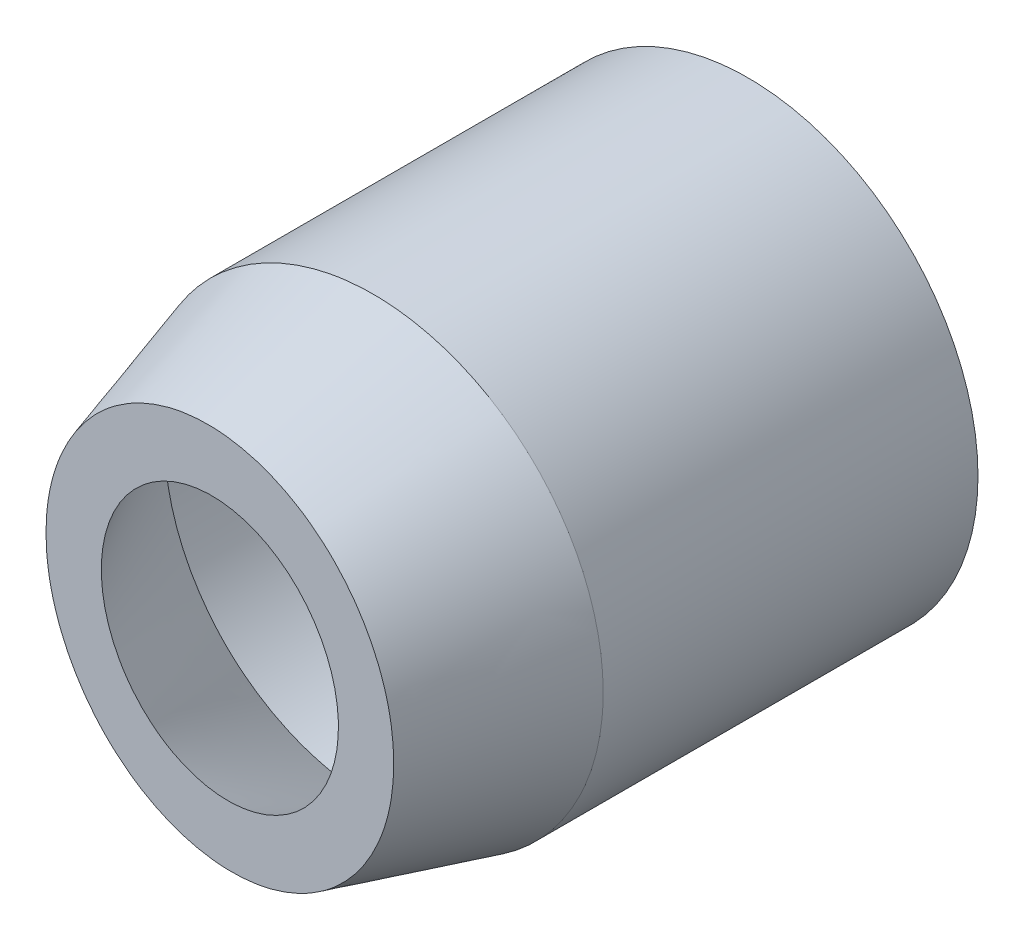
ISO-10303-21;
HEADER;
FILE_DESCRIPTION(('STEP AP214'),'2;1');
FILE_NAME('part.step','',(''),(''),'','','');
FILE_SCHEMA(('AUTOMOTIVE_DESIGN { 1 0 10303 214 1 1 1 1 }'));
ENDSEC;
DATA;
#1=APPLICATION_CONTEXT('core data for automotive mechanical design processes');
#2=APPLICATION_PROTOCOL_DEFINITION('international standard','automotive_design',2000,#1);
#3=PRODUCT_CONTEXT('',#1,'mechanical');
#4=PRODUCT('Part','Part','',(#3));
#5=PRODUCT_RELATED_PRODUCT_CATEGORY('part','',(#4));
#6=PRODUCT_DEFINITION_FORMATION('','',#4);
#7=PRODUCT_DEFINITION_CONTEXT('part definition',#1,'design');
#8=PRODUCT_DEFINITION('design','',#6,#7);
#9=PRODUCT_DEFINITION_SHAPE('','',#8);
#10=(LENGTH_UNIT() NAMED_UNIT(*) SI_UNIT(.MILLI.,.METRE.));
#11=(NAMED_UNIT(*) PLANE_ANGLE_UNIT() SI_UNIT($,.RADIAN.));
#12=(NAMED_UNIT(*) SI_UNIT($,.STERADIAN.) SOLID_ANGLE_UNIT());
#13=UNCERTAINTY_MEASURE_WITH_UNIT(LENGTH_MEASURE(1.E-05),#10,'distance_accuracy_value','');
#14=(GEOMETRIC_REPRESENTATION_CONTEXT(3) GLOBAL_UNCERTAINTY_ASSIGNED_CONTEXT((#13)) GLOBAL_UNIT_ASSIGNED_CONTEXT((#10,
#11,#12)) REPRESENTATION_CONTEXT('',''));
#15=CARTESIAN_POINT('',(0.,0.,0.));
#16=DIRECTION('',(0.,0.,1.));
#17=DIRECTION('',(1.,0.,0.));
#18=AXIS2_PLACEMENT_3D('',#15,#16,#17);
#19=CARTESIAN_POINT('',(0.,0.,0.));
#20=DIRECTION('',(0.,0.,1.));
#21=DIRECTION('',(1.,0.,0.));
#22=AXIS2_PLACEMENT_3D('',#19,#20,#21);
#23=PLANE('',#22);
#24=CARTESIAN_POINT('',(0.,0.,0.));
#25=DIRECTION('',(0.,0.,1.));
#26=DIRECTION('',(1.,0.,0.));
#27=AXIS2_PLACEMENT_3D('',#24,#25,#26);
#28=CIRCLE('',#27,13.5);
#29=CARTESIAN_POINT('',(13.5,0.,0.));
#30=VERTEX_POINT('',#29);
#31=EDGE_CURVE('E75',#30,#30,#28,.T.);
#32=ORIENTED_EDGE('',*,*,#31,.F.);
#33=EDGE_LOOP('',(#32));
#34=FACE_BOUND('',#33,.T.);
#35=CARTESIAN_POINT('',(0.,0.,0.));
#36=DIRECTION('',(0.,0.,1.));
#37=DIRECTION('',(1.,0.,0.));
#38=AXIS2_PLACEMENT_3D('',#35,#36,#37);
#39=CIRCLE('',#38,12.25);
#40=CARTESIAN_POINT('',(12.25,0.,0.));
#41=VERTEX_POINT('',#40);
#42=EDGE_CURVE('E81',#41,#41,#39,.T.);
#43=ORIENTED_EDGE('',*,*,#42,.T.);
#44=EDGE_LOOP('',(#43));
#45=FACE_BOUND('',#44,.T.);
#46=ADVANCED_FACE('F63',(#34,#45),#23,.F.);
#47=CARTESIAN_POINT('',(0.,0.,22.));
#48=DIRECTION('',(0.,0.,-1.));
#49=DIRECTION('',(-1.,0.,0.));
#50=AXIS2_PLACEMENT_3D('',#47,#48,#49);
#51=CYLINDRICAL_SURFACE('',#50,13.5);
#52=CARTESIAN_POINT('',(13.5,0.,21.999999942));
#53=CARTESIAN_POINT('',(13.5,0.5625,21.999999942));
#54=CARTESIAN_POINT('',(13.4651108152557,1.16050591275746,21.999999942));
#55=CARTESIAN_POINT('',(13.295951131647,2.42356488370272,21.999999942));
#56=CARTESIAN_POINT('',(13.1616,3.0888,21.999999942));
#57=CARTESIAN_POINT('',(12.7584,4.4712,21.999999942));
#58=CARTESIAN_POINT('',(12.4893321550309,5.18854942557758,21.999999942));
#59=CARTESIAN_POINT('',(11.7803307663174,6.64291124857972,21.999999942));
#60=CARTESIAN_POINT('',(11.34,7.38,21.999999942));
#61=CARTESIAN_POINT('',(10.26,8.82,21.999999942));
#62=CARTESIAN_POINT('',(9.61981610058172,9.52270594858322,21.999999942));
#63=CARTESIAN_POINT('',(8.13360855695252,10.8197598048414,21.999999942));
#64=CARTESIAN_POINT('',(7.28719723183391,11.4134948096886,21.999999942));
#65=CARTESIAN_POINT('',(5.41868512110727,12.4100346020761,21.999999942));
#66=CARTESIAN_POINT('',(4.39668639053255,12.8119526627219,21.999999942));
#67=CARTESIAN_POINT('',(2.2494674556213,13.3572781065089,21.999999942));
#68=CARTESIAN_POINT('',(1.125,13.5,21.999999942));
#69=CARTESIAN_POINT('',(-1.125,13.5,21.999999942));
#70=CARTESIAN_POINT('',(-2.2494674556213,13.3572781065089,21.999999942));
#71=CARTESIAN_POINT('',(-4.39668639053254,12.8119526627219,21.999999942));
#72=CARTESIAN_POINT('',(-5.41868512110727,12.4100346020761,21.999999942));
#73=CARTESIAN_POINT('',(-7.28719723183391,11.4134948096886,21.999999942));
#74=CARTESIAN_POINT('',(-8.13360855695252,10.8197598048414,21.999999942));
#75=CARTESIAN_POINT('',(-9.61981610058172,9.52270594858322,21.999999942));
#76=CARTESIAN_POINT('',(-10.26,8.82,21.999999942));
#77=CARTESIAN_POINT('',(-11.34,7.38,21.999999942));
#78=CARTESIAN_POINT('',(-11.7803307663174,6.64291124857973,21.999999942));
#79=CARTESIAN_POINT('',(-12.4893321550309,5.18854942557758,21.999999942));
#80=CARTESIAN_POINT('',(-12.7584,4.4712,21.999999942));
#81=CARTESIAN_POINT('',(-13.1616,3.0888,21.999999942));
#82=CARTESIAN_POINT('',(-13.295951131647,2.42356488370272,21.999999942));
#83=CARTESIAN_POINT('',(-13.4651108152557,1.16050591275746,21.999999942));
#84=CARTESIAN_POINT('',(-13.5,0.562500000000001,21.999999942));
#85=CARTESIAN_POINT('',(-13.5,-0.562499999999998,21.999999942));
#86=CARTESIAN_POINT('',(-13.4651108152557,-1.16050591275746,21.999999942));
#87=CARTESIAN_POINT('',(-13.295951131647,-2.42356488370272,21.999999942));
#88=CARTESIAN_POINT('',(-13.1616,-3.0888,21.999999942));
#89=CARTESIAN_POINT('',(-12.7584,-4.4712,21.999999942));
#90=CARTESIAN_POINT('',(-12.4893321550309,-5.18854942557758,21.999999942));
#91=CARTESIAN_POINT('',(-11.7803307663174,-6.64291124857972,21.999999942));
#92=CARTESIAN_POINT('',(-11.34,-7.37999999999999,21.999999942));
#93=CARTESIAN_POINT('',(-10.26,-8.82,21.999999942));
#94=CARTESIAN_POINT('',(-9.61981610058172,-9.52270594858322,21.999999942));
#95=CARTESIAN_POINT('',(-8.13360855695253,-10.8197598048414,21.999999942));
#96=CARTESIAN_POINT('',(-7.28719723183391,-11.4134948096886,21.999999942));
#97=CARTESIAN_POINT('',(-5.41868512110727,-12.4100346020761,21.999999942));
#98=CARTESIAN_POINT('',(-4.39668639053255,-12.8119526627219,21.999999942));
#99=CARTESIAN_POINT('',(-2.2494674556213,-13.3572781065089,21.999999942));
#100=CARTESIAN_POINT('',(-1.12499999999999,-13.5,21.999999942));
#101=CARTESIAN_POINT('',(1.125,-13.5,21.999999942));
#102=CARTESIAN_POINT('',(2.2494674556213,-13.3572781065089,21.999999942));
#103=CARTESIAN_POINT('',(4.39668639053254,-12.8119526627219,21.999999942));
#104=CARTESIAN_POINT('',(5.41868512110727,-12.4100346020761,21.999999942));
#105=CARTESIAN_POINT('',(7.28719723183391,-11.4134948096886,21.999999942));
#106=CARTESIAN_POINT('',(8.13360855695252,-10.8197598048414,21.999999942));
#107=CARTESIAN_POINT('',(9.61981610058172,-9.52270594858322,21.999999942));
#108=CARTESIAN_POINT('',(10.26,-8.82,21.999999942));
#109=CARTESIAN_POINT('',(11.34,-7.38,21.999999942));
#110=CARTESIAN_POINT('',(11.7803307663174,-6.64291124857973,21.999999942));
#111=CARTESIAN_POINT('',(12.4893321550309,-5.18854942557758,21.999999942));
#112=CARTESIAN_POINT('',(12.7584,-4.4712,21.999999942));
#113=CARTESIAN_POINT('',(13.1616,-3.0888,21.999999942));
#114=CARTESIAN_POINT('',(13.295951131647,-2.42356488370272,21.999999942));
#115=CARTESIAN_POINT('',(13.4651108152557,-1.16050591275746,21.999999942));
#116=CARTESIAN_POINT('',(13.5,-0.562499999999997,21.999999942));
#117=CARTESIAN_POINT('',(13.5,0.,21.999999942));
#118=B_SPLINE_CURVE_WITH_KNOTS('',3,(#52,#53,#54,#55,#56,#57,#58,#59,#60,#61,#62,#63,#64,#65,
#66,#67,#68,#69,#70,#71,#72,#73,#74,#75,#76,#77,#78,#79,#80,#81,#82,#83,#84,#85,#86,#87,#88,#89,
#90,#91,#92,#93,#94,#95,#96,#97,#98,#99,#100,#101,#102,#103,#104,#105,#106,#107,#108,#109,#110,
#111,#112,#113,#114,#115,#116,#117),.UNSPECIFIED.,.T.,.F.,(4,2,2,2,2,2,2,2,2,2,2,2,2,2,2,2,2,2,
2,2,2,2,2,2,2,2,2,2,2,2,2,2,4),(0.,0.03125,0.0625,0.09375,0.125,0.15625,0.1875,0.21875,0.25,
0.28125,0.3125,0.34375,0.375,0.40625,0.4375,0.46875,0.5,0.53125,0.5625,0.59375,0.625,0.65625,
0.6875,0.71875,0.75,0.78125,0.8125,0.84375,0.875,0.90625,0.9375,0.96875,1.),.UNSPECIFIED.);
#119=CARTESIAN_POINT('',(13.5,0.,21.999999942));
#120=VERTEX_POINT('',#119);
#121=EDGE_CURVE('E11',#120,#120,#118,.T.);
#122=ORIENTED_EDGE('',*,*,#121,.F.);
#123=EDGE_LOOP('',(#122));
#124=FACE_BOUND('',#123,.T.);
#125=ORIENTED_EDGE('',*,*,#31,.T.);
#126=EDGE_LOOP('',(#125));
#127=FACE_BOUND('',#126,.T.);
#128=ADVANCED_FACE('F65',(#124,#127),#51,.T.);
#129=CARTESIAN_POINT('',(0.,0.,22.));
#130=DIRECTION('',(0.,0.,-1.));
#131=DIRECTION('',(-1.,0.,0.));
#132=AXIS2_PLACEMENT_3D('',#129,#130,#131);
#133=CYLINDRICAL_SURFACE('',#132,12.25);
#134=CARTESIAN_POINT('',(0.,0.,21.999999942));
#135=DIRECTION('',(0.,0.,1.));
#136=DIRECTION('',(1.,0.,0.));
#137=AXIS2_PLACEMENT_3D('',#134,#135,#136);
#138=CIRCLE('',#137,12.25);
#139=CARTESIAN_POINT('',(6.40716884169675,10.4408183316247,21.999999942));
#140=VERTEX_POINT('',#139);
#141=EDGE_CURVE('E105',#140,#140,#138,.T.);
#142=ORIENTED_EDGE('',*,*,#141,.T.);
#143=EDGE_LOOP('',(#142));
#144=FACE_BOUND('',#143,.T.);
#145=ORIENTED_EDGE('',*,*,#42,.F.);
#146=EDGE_LOOP('',(#145));
#147=FACE_BOUND('',#146,.T.);
#148=ADVANCED_FACE('F110',(#144,#147),#133,.F.);
#149=CARTESIAN_POINT('',(0.,0.,30.999999976));
#150=DIRECTION('',(-0.0697564737441255,0.,0.997564050259824));
#151=DIRECTION('',(0.997564050259824,0.,0.0697564737441255));
#152=AXIS2_PLACEMENT_3D('',#149,#150,#151);
#153=PLANE('',#152);
#154=CARTESIAN_POINT('',(0.,0.,30.999999976));
#155=DIRECTION('',(-0.0697564737441255,0.,0.997564050259824));
#156=DIRECTION('',(0.997564050259824,0.,0.0697564737441255));
#157=AXIS2_PLACEMENT_3D('',#154,#155,#156);
#158=CIRCLE('',#157,7.5);
#159=CARTESIAN_POINT('',(4.9159422917228,5.6537901516199,31.3437561481585));
#160=VERTEX_POINT('',#159);
#161=EDGE_CURVE('E201',#160,#160,#158,.T.);
#162=ORIENTED_EDGE('',*,*,#161,.F.);
#163=EDGE_LOOP('',(#162));
#164=FACE_BOUND('',#163,.T.);
#165=CARTESIAN_POINT('',(0.,0.,30.999999976));
#166=DIRECTION('',(-0.0697564737441255,0.,0.997564050259824));
#167=DIRECTION('',(0.997564050259824,0.,0.0697564737441255));
#168=AXIS2_PLACEMENT_3D('',#165,#166,#167);
#169=CIRCLE('',#168,11.);
#170=CARTESIAN_POINT('',(10.9732045528581,0.,31.7673211871854));
#171=VERTEX_POINT('',#170);
#172=EDGE_CURVE('E87',#171,#171,#169,.T.);
#173=ORIENTED_EDGE('',*,*,#172,.T.);
#174=EDGE_LOOP('',(#173));
#175=FACE_BOUND('',#174,.T.);
#176=ADVANCED_FACE('F118',(#164,#175),#153,.T.);
#177=CARTESIAN_POINT('',(13.5,0.,21.999999942));
#178=CARTESIAN_POINT('',(10.9732045528581,0.,31.7673211871854));
#179=CARTESIAN_POINT('',(13.5,0.5625,21.999999942));
#180=CARTESIAN_POINT('',(10.9732045528581,0.458333333333333,31.7673211871854));
#181=CARTESIAN_POINT('',(13.4651108152557,1.16050591275746,21.999999942));
#182=CARTESIAN_POINT('',(10.9448455779779,0.945597410394967,31.765338134482));
#183=CARTESIAN_POINT('',(13.295951131647,2.42356488370272,21.999999942));
#184=CARTESIAN_POINT('',(10.8073475179531,1.97475657190592,31.7557233334961));
#185=CARTESIAN_POINT('',(13.1616,3.0888,21.999999942));
#186=CARTESIAN_POINT('',(10.6981428920664,2.5168,31.7480870021583));
#187=CARTESIAN_POINT('',(12.7584,4.4712,21.999999942));
#188=CARTESIAN_POINT('',(10.3704098494211,3.6432,31.7251696753176));
#189=CARTESIAN_POINT('',(12.4893321550309,5.18854942557758,21.999999942));
#190=CARTESIAN_POINT('',(10.1517034419068,4.22770693935951,31.7098762334885));
#191=CARTESIAN_POINT('',(11.7803307663174,6.64291124857972,21.999999942));
#192=CARTESIAN_POINT('',(9.57540586660206,5.41274249884274,31.6695775813167));
#193=CARTESIAN_POINT('',(11.34,7.38,21.999999942));
#194=CARTESIAN_POINT('',(9.21749182440077,6.01333333333333,31.6445497933957));
#195=CARTESIAN_POINT('',(10.26,8.82,21.999999942));
#196=CARTESIAN_POINT('',(8.33963546017213,7.18666666666667,31.5831640965009));
#197=CARTESIAN_POINT('',(9.61981610058172,9.52270594858322,21.999999942));
#198=CARTESIAN_POINT('',(7.8192748024119,7.75924188403077,31.5467769346429));
#199=CARTESIAN_POINT('',(8.13360855695252,10.8197598048414,21.999999942));
#200=CARTESIAN_POINT('',(6.61124077394939,8.81610058172265,31.4623029663132));
#201=CARTESIAN_POINT('',(7.28719723183391,11.4134948096886,21.999999942));
#202=CARTESIAN_POINT('',(5.92325228458775,9.29988465974625,31.4141941245983));
#203=CARTESIAN_POINT('',(5.41868512110727,12.4100346020761,21.999999942));
#204=CARTESIAN_POINT('',(4.40446964751397,10.1118800461361,31.3079904967526));
#205=CARTESIAN_POINT('',(4.39668639053255,12.8119526627219,21.999999942));
#206=CARTESIAN_POINT('',(3.57375845319117,10.4393688362919,31.2499015112879));
#207=CARTESIAN_POINT('',(2.2494674556213,13.3572781065089,21.999999942));
#208=CARTESIAN_POINT('',(1.82843455744665,10.883708086785,31.1278565754496));
#209=CARTESIAN_POINT('',(1.125,13.5,21.999999942));
#210=CARTESIAN_POINT('',(0.914433712738173,11.,31.0639434102655));
#211=CARTESIAN_POINT('',(-1.125,13.5,21.999999942));
#212=CARTESIAN_POINT('',(-0.914433712738171,11.,30.9360565417346));
#213=CARTESIAN_POINT('',(-2.2494674556213,13.3572781065089,21.999999942));
#214=CARTESIAN_POINT('',(-1.82843455744664,10.883708086785,30.8721433765504));
#215=CARTESIAN_POINT('',(-4.39668639053254,12.8119526627219,21.999999942));
#216=CARTESIAN_POINT('',(-3.57375845319117,10.4393688362919,30.7500984407122));
#217=CARTESIAN_POINT('',(-5.41868512110727,12.4100346020761,21.999999942));
#218=CARTESIAN_POINT('',(-4.40446964751396,10.1118800461361,30.6920094552474));
#219=CARTESIAN_POINT('',(-7.28719723183391,11.4134948096886,21.999999942));
#220=CARTESIAN_POINT('',(-5.92325228458774,9.29988465974625,30.5858058274017));
#221=CARTESIAN_POINT('',(-8.13360855695252,10.8197598048414,21.999999942));
#222=CARTESIAN_POINT('',(-6.61124077394939,8.81610058172265,30.5376969856868));
#223=CARTESIAN_POINT('',(-9.61981610058172,9.52270594858322,21.999999942));
#224=CARTESIAN_POINT('',(-7.8192748024119,7.75924188403078,30.4532230173571));
#225=CARTESIAN_POINT('',(-10.26,8.82,21.999999942));
#226=CARTESIAN_POINT('',(-8.33963546017213,7.18666666666667,30.4168358554991));
#227=CARTESIAN_POINT('',(-11.34,7.38,21.999999942));
#228=CARTESIAN_POINT('',(-9.21749182440077,6.01333333333334,30.3554501586043));
#229=CARTESIAN_POINT('',(-11.7803307663174,6.64291124857973,21.999999942));
#230=CARTESIAN_POINT('',(-9.57540586660206,5.41274249884274,30.3304223706833));
#231=CARTESIAN_POINT('',(-12.4893321550309,5.18854942557758,21.999999942));
#232=CARTESIAN_POINT('',(-10.1517034419068,4.22770693935951,30.2901237185115));
#233=CARTESIAN_POINT('',(-12.7584,4.4712,21.999999942));
#234=CARTESIAN_POINT('',(-10.3704098494211,3.6432,30.2748302766824));
#235=CARTESIAN_POINT('',(-13.1616,3.0888,21.999999942));
#236=CARTESIAN_POINT('',(-10.6981428920664,2.5168,30.2519129498417));
#237=CARTESIAN_POINT('',(-13.295951131647,2.42356488370272,21.999999942));
#238=CARTESIAN_POINT('',(-10.8073475179531,1.97475657190592,30.2442766185039));
#239=CARTESIAN_POINT('',(-13.4651108152557,1.16050591275746,21.999999942));
#240=CARTESIAN_POINT('',(-10.9448455779779,0.945597410394967,30.234661817518));
#241=CARTESIAN_POINT('',(-13.5,0.562500000000001,21.999999942));
#242=CARTESIAN_POINT('',(-10.9732045528581,0.458333333333333,30.2326787648146));
#243=CARTESIAN_POINT('',(-13.5,-0.562499999999998,21.999999942));
#244=CARTESIAN_POINT('',(-10.9732045528581,-0.458333333333332,30.2326787648146));
#245=CARTESIAN_POINT('',(-13.4651108152557,-1.16050591275746,21.999999942));
#246=CARTESIAN_POINT('',(-10.9448455779779,-0.945597410394966,30.234661817518));
#247=CARTESIAN_POINT('',(-13.295951131647,-2.42356488370272,21.999999942));
#248=CARTESIAN_POINT('',(-10.8073475179531,-1.97475657190592,30.2442766185039));
#249=CARTESIAN_POINT('',(-13.1616,-3.0888,21.999999942));
#250=CARTESIAN_POINT('',(-10.6981428920664,-2.5168,30.2519129498417));
#251=CARTESIAN_POINT('',(-12.7584,-4.4712,21.999999942));
#252=CARTESIAN_POINT('',(-10.3704098494211,-3.6432,30.2748302766824));
#253=CARTESIAN_POINT('',(-12.4893321550309,-5.18854942557758,21.999999942));
#254=CARTESIAN_POINT('',(-10.1517034419068,-4.22770693935951,30.2901237185115));
#255=CARTESIAN_POINT('',(-11.7803307663174,-6.64291124857972,21.999999942));
#256=CARTESIAN_POINT('',(-9.57540586660206,-5.41274249884274,30.3304223706833));
#257=CARTESIAN_POINT('',(-11.34,-7.37999999999999,21.999999942));
#258=CARTESIAN_POINT('',(-9.21749182440078,-6.01333333333333,30.3554501586043));
#259=CARTESIAN_POINT('',(-10.26,-8.82,21.999999942));
#260=CARTESIAN_POINT('',(-8.33963546017213,-7.18666666666667,30.4168358554991));
#261=CARTESIAN_POINT('',(-9.61981610058172,-9.52270594858322,21.999999942));
#262=CARTESIAN_POINT('',(-7.8192748024119,-7.75924188403077,30.4532230173571));
#263=CARTESIAN_POINT('',(-8.13360855695253,-10.8197598048414,21.999999942));
#264=CARTESIAN_POINT('',(-6.61124077394939,-8.81610058172265,30.5376969856868));
#265=CARTESIAN_POINT('',(-7.28719723183391,-11.4134948096886,21.999999942));
#266=CARTESIAN_POINT('',(-5.92325228458775,-9.29988465974625,30.5858058274017));
#267=CARTESIAN_POINT('',(-5.41868512110727,-12.4100346020761,21.999999942));
#268=CARTESIAN_POINT('',(-4.40446964751397,-10.1118800461361,30.6920094552474));
#269=CARTESIAN_POINT('',(-4.39668639053255,-12.8119526627219,21.999999942));
#270=CARTESIAN_POINT('',(-3.57375845319117,-10.4393688362919,30.7500984407122));
#271=CARTESIAN_POINT('',(-2.2494674556213,-13.3572781065089,21.999999942));
#272=CARTESIAN_POINT('',(-1.82843455744665,-10.883708086785,30.8721433765504));
#273=CARTESIAN_POINT('',(-1.12499999999999,-13.5,21.999999942));
#274=CARTESIAN_POINT('',(-0.914433712738166,-11.,30.9360565417346));
#275=CARTESIAN_POINT('',(1.125,-13.5,21.999999942));
#276=CARTESIAN_POINT('',(0.914433712738167,-11.,31.0639434102654));
#277=CARTESIAN_POINT('',(2.2494674556213,-13.3572781065089,21.999999942));
#278=CARTESIAN_POINT('',(1.82843455744664,-10.883708086785,31.1278565754496));
#279=CARTESIAN_POINT('',(4.39668639053254,-12.8119526627219,21.999999942));
#280=CARTESIAN_POINT('',(3.57375845319117,-10.4393688362919,31.2499015112878));
#281=CARTESIAN_POINT('',(5.41868512110727,-12.4100346020761,21.999999942));
#282=CARTESIAN_POINT('',(4.40446964751396,-10.1118800461361,31.3079904967526));
#283=CARTESIAN_POINT('',(7.28719723183391,-11.4134948096886,21.999999942));
#284=CARTESIAN_POINT('',(5.92325228458775,-9.29988465974625,31.4141941245983));
#285=CARTESIAN_POINT('',(8.13360855695252,-10.8197598048414,21.999999942));
#286=CARTESIAN_POINT('',(6.61124077394939,-8.81610058172265,31.4623029663132));
#287=CARTESIAN_POINT('',(9.61981610058172,-9.52270594858322,21.999999942));
#288=CARTESIAN_POINT('',(7.8192748024119,-7.75924188403078,31.5467769346429));
#289=CARTESIAN_POINT('',(10.26,-8.82,21.999999942));
#290=CARTESIAN_POINT('',(8.33963546017213,-7.18666666666666,31.5831640965009));
#291=CARTESIAN_POINT('',(11.34,-7.38,21.999999942));
#292=CARTESIAN_POINT('',(9.21749182440077,-6.01333333333333,31.6445497933957));
#293=CARTESIAN_POINT('',(11.7803307663174,-6.64291124857973,21.999999942));
#294=CARTESIAN_POINT('',(9.57540586660206,-5.41274249884274,31.6695775813167));
#295=CARTESIAN_POINT('',(12.4893321550309,-5.18854942557758,21.999999942));
#296=CARTESIAN_POINT('',(10.1517034419068,-4.22770693935951,31.7098762334885));
#297=CARTESIAN_POINT('',(12.7584,-4.4712,21.999999942));
#298=CARTESIAN_POINT('',(10.3704098494211,-3.6432,31.7251696753176));
#299=CARTESIAN_POINT('',(13.1616,-3.0888,21.999999942));
#300=CARTESIAN_POINT('',(10.6981428920664,-2.5168,31.7480870021583));
#301=CARTESIAN_POINT('',(13.295951131647,-2.42356488370272,21.999999942));
#302=CARTESIAN_POINT('',(10.8073475179531,-1.97475657190592,31.7557233334961));
#303=CARTESIAN_POINT('',(13.4651108152557,-1.16050591275746,21.999999942));
#304=CARTESIAN_POINT('',(10.9448455779779,-0.945597410394966,31.765338134482));
#305=CARTESIAN_POINT('',(13.5,-0.562499999999997,21.999999942));
#306=CARTESIAN_POINT('',(10.9732045528581,-0.458333333333332,31.7673211871854));
#307=CARTESIAN_POINT('',(13.5,0.,21.999999942));
#308=CARTESIAN_POINT('',(10.9732045528581,0.,31.7673211871854));
#309=B_SPLINE_SURFACE_WITH_KNOTS('',3,1,((#177,#178),(#179,#180),(#181,#182),(#183,#184),(#185,
#186),(#187,#188),(#189,#190),(#191,#192),(#193,#194),(#195,#196),(#197,#198),(#199,#200),(#201,
#202),(#203,#204),(#205,#206),(#207,#208),(#209,#210),(#211,#212),(#213,#214),(#215,#216),(#217,
#218),(#219,#220),(#221,#222),(#223,#224),(#225,#226),(#227,#228),(#229,#230),(#231,#232),(#233,
#234),(#235,#236),(#237,#238),(#239,#240),(#241,#242),(#243,#244),(#245,#246),(#247,#248),(#249,
#250),(#251,#252),(#253,#254),(#255,#256),(#257,#258),(#259,#260),(#261,#262),(#263,#264),(#265,
#266),(#267,#268),(#269,#270),(#271,#272),(#273,#274),(#275,#276),(#277,#278),(#279,#280),(#281,
#282),(#283,#284),(#285,#286),(#287,#288),(#289,#290),(#291,#292),(#293,#294),(#295,#296),(#297,
#298),(#299,#300),(#301,#302),(#303,#304),(#305,#306),(#307,#308)),.UNSPECIFIED.,.T.,.F.,.F.,(4,
2,2,2,2,2,2,2,2,2,2,2,2,2,2,2,2,2,2,2,2,2,2,2,2,2,2,2,2,2,2,2,4),(2,2),(0.,0.03125,0.0625,
0.09375,0.125,0.15625,0.1875,0.21875,0.25,0.28125,0.3125,0.34375,0.375,0.40625,0.4375,0.46875,
0.5,0.53125,0.5625,0.59375,0.625,0.65625,0.6875,0.71875,0.75,0.78125,0.8125,0.84375,0.875,
0.90625,0.9375,0.96875,1.),(0.,1.),.UNSPECIFIED.);
#310=ORIENTED_EDGE('',*,*,#121,.T.);
#311=EDGE_LOOP('',(#310));
#312=FACE_BOUND('',#311,.T.);
#313=ORIENTED_EDGE('',*,*,#172,.F.);
#314=EDGE_LOOP('',(#313));
#315=FACE_BOUND('',#314,.T.);
#316=ADVANCED_FACE('F142',(#312,#315),#309,.T.);
#317=CARTESIAN_POINT('',(6.40716884169675,10.4408183316247,21.999999942));
#318=CARTESIAN_POINT('',(4.9159422917228,5.6537901516199,31.3437561481585));
#319=CARTESIAN_POINT('',(5.97213474454572,10.7077837000287,21.999999942));
#320=CARTESIAN_POINT('',(4.68094154993242,5.85912125669374,31.3273232954807));
#321=CARTESIAN_POINT('',(5.49308200426839,10.964617271267,21.999999942));
#322=CARTESIAN_POINT('',(4.41807103900823,6.06359914720965,31.3089415986978));
#323=CARTESIAN_POINT('',(4.43595578857524,11.4332444237316,21.999999942));
#324=CARTESIAN_POINT('',(3.82874022985417,6.45382984019649,31.2677315740336));
#325=CARTESIAN_POINT('',(3.85770324178915,11.6450620497589,21.999999942));
#326=CARTESIAN_POINT('',(3.5022799316243,6.63958264266742,31.2449032461522));
#327=CARTESIAN_POINT('',(2.59720266855877,11.9893236983108,21.999999942));
#328=CARTESIAN_POINT('',(2.77791929882081,6.97534450063517,31.1942510164029));
#329=CARTESIAN_POINT('',(1.91470799112624,12.1216859501601,21.999999942));
#330=CARTESIAN_POINT('',(2.38024629662575,7.12451535061047,31.1664430111634));
#331=CARTESIAN_POINT('',(0.453417680837272,12.2635961027871,21.999999942));
#332=CARTESIAN_POINT('',(1.51446581622888,7.35847625565255,31.1059017423263));
#333=CARTESIAN_POINT('',(-0.325625527596238,12.2728730320256,21.999999942));
#334=CARTESIAN_POINT('',(1.0461817927574,7.44312782592947,31.0731561334809));
#335=CARTESIAN_POINT('',(-1.95188632363861,12.12103890861,21.999999942));
#336=CARTESIAN_POINT('',(0.0513045104362149,7.5164722427889,31.0035875368531));
#337=CARTESIAN_POINT('',(-2.79918939645477,11.9594323801641,21.999999942));
#338=CARTESIAN_POINT('',(-0.475390390740969,7.50487460644761,30.9667574415469));
#339=CARTESIAN_POINT('',(-4.50768468129631,11.4255968311046,21.999999942));
#340=CARTESIAN_POINT('',(-1.55846575064543,7.35591952985982,30.8910214345342));
#341=CARTESIAN_POINT('',(-5.36858687331815,11.0527770936148,21.999999942));
#342=CARTESIAN_POINT('',(-2.11473132301043,7.21817599932765,30.8521235564648));
#343=CARTESIAN_POINT('',(-7.02611009618734,10.0806439979674,21.999999942));
#344=CARTESIAN_POINT('',(-3.21147205472526,6.79941447591246,30.7754319735674));
#345=CARTESIAN_POINT('',(-7.82199690197944,9.48098872344906,21.999999942));
#346=CARTESIAN_POINT('',(-3.75153959539905,6.51811553895729,30.7376667722139));
#347=CARTESIAN_POINT('',(-9.26282935725774,8.07915682525524,21.999999942));
#348=CARTESIAN_POINT('',(-4.76126178673896,5.81792363942921,30.6670601184249));
#349=CARTESIAN_POINT('',(-9.90688759481664,7.2772370359988,21.999999942));
#350=CARTESIAN_POINT('',(-5.23035594532548,5.39909570107377,30.6342578594136));
#351=CARTESIAN_POINT('',(-10.9747490684328,5.53710064739469,21.999999942));
#352=CARTESIAN_POINT('',(-6.04967966061262,4.45679734247045,30.5769651640539));
#353=CARTESIAN_POINT('',(-11.3980468079344,4.59970778124872,21.999999942));
#354=CARTESIAN_POINT('',(-6.39952137176753,3.93377298061719,30.5525018485079));
#355=CARTESIAN_POINT('',(-11.9953764646657,2.68024741016358,21.999999942));
#356=CARTESIAN_POINT('',(-6.95359242068217,2.83545743309742,30.5137574264671));
#357=CARTESIAN_POINT('',(-12.169581277065,1.6990874134105,21.999999942));
#358=CARTESIAN_POINT('',(-7.15783403285567,2.26073172443904,30.4994754616616));
#359=CARTESIAN_POINT('',(-12.2856688062226,-0.218971416651263,21.999999942));
#360=CARTESIAN_POINT('',(-7.42190777635823,1.11443023010478,30.4810096266605));
#361=CARTESIAN_POINT('',(-12.2281888763577,-1.15537047610863,21.999999942));
#362=CARTESIAN_POINT('',(-7.48207320093303,0.543220869648039,30.4768024503308));
#363=CARTESIAN_POINT('',(-11.9304169494177,-2.92038277388218,21.999999942));
#364=CARTESIAN_POINT('',(-7.48138458443661,-0.552669323902532,30.476850603087));
#365=CARTESIAN_POINT('',(-11.6907829630177,-3.74900495545957,21.999999942));
#366=CARTESIAN_POINT('',(-7.42092777298244,-1.07728878767334,30.4810781551723));
#367=CARTESIAN_POINT('',(-11.0896691816468,-5.26770176510386,21.999999942));
#368=CARTESIAN_POINT('',(-7.2126012573369,-2.05523962879196,30.4956457642547));
#369=CARTESIAN_POINT('',(-10.7285924274339,-5.95807699611202,21.999999942));
#370=CARTESIAN_POINT('',(-7.06500473556711,-2.50871160648525,30.505966718476));
#371=CARTESIAN_POINT('',(-9.94029346625383,-7.19666191858019,21.999999942));
#372=CARTESIAN_POINT('',(-6.71558127912092,-3.3365310402671,30.5304007868035));
#373=CARTESIAN_POINT('',(-9.51320073142698,-7.74521505757082,21.999999942));
#374=CARTESIAN_POINT('',(-6.51386709150751,-3.71107272461332,30.5445060168671));
#375=CARTESIAN_POINT('',(-8.63542171034061,-8.71314158779843,21.999999942));
#376=CARTESIAN_POINT('',(-6.08315207826294,-4.38455431430451,30.5746245445995));
#377=CARTESIAN_POINT('',(-8.18469662793009,-9.1327719187404,21.999999942));
#378=CARTESIAN_POINT('',(-5.85501062586752,-4.68338291980784,30.5905777490377));
#379=CARTESIAN_POINT('',(-7.28813850913905,-9.86305322314483,21.999999942));
#380=CARTESIAN_POINT('',(-5.38890610349264,-5.21533528592861,30.6231709523198));
#381=CARTESIAN_POINT('',(-6.84220293884777,-10.1738529632207,21.999999942));
#382=CARTESIAN_POINT('',(-5.15094303351318,-5.44845904654606,30.6398109511638));
#383=CARTESIAN_POINT('',(-5.97213474454571,-10.7077837000287,21.999999942));
#384=CARTESIAN_POINT('',(-4.68094154993242,-5.85912125669374,30.6726766565193));
#385=CARTESIAN_POINT('',(-5.49308200426839,-10.964617271267,21.999999942));
#386=CARTESIAN_POINT('',(-4.41807103900823,-6.06359914720965,30.6910583533022));
#387=CARTESIAN_POINT('',(-4.43595578857524,-11.4332444237316,21.999999942));
#388=CARTESIAN_POINT('',(-3.82874022985417,-6.45382984019649,30.7322683779664));
#389=CARTESIAN_POINT('',(-3.85770324178915,-11.6450620497589,21.999999942));
#390=CARTESIAN_POINT('',(-3.5022799316243,-6.63958264266742,30.7550967058478));
#391=CARTESIAN_POINT('',(-2.59720266855877,-11.9893236983107,21.999999942));
#392=CARTESIAN_POINT('',(-2.77791929882081,-6.97534450063517,30.8057489355971));
#393=CARTESIAN_POINT('',(-1.91470799112624,-12.1216859501601,21.999999942));
#394=CARTESIAN_POINT('',(-2.38024629662575,-7.12451535061047,30.8335569408366));
#395=CARTESIAN_POINT('',(-0.453417680837271,-12.2635961027871,21.999999942));
#396=CARTESIAN_POINT('',(-1.51446581622888,-7.35847625565255,30.8940982096737));
#397=CARTESIAN_POINT('',(0.325625527596242,-12.2728730320256,21.999999942));
#398=CARTESIAN_POINT('',(-1.04618179275741,-7.44312782592947,30.9268438185191));
#399=CARTESIAN_POINT('',(1.95188632363861,-12.12103890861,21.999999942));
#400=CARTESIAN_POINT('',(-0.0513045104362168,-7.5164722427889,30.9964124151469));
#401=CARTESIAN_POINT('',(2.79918939645477,-11.9594323801641,21.999999942));
#402=CARTESIAN_POINT('',(0.475390390740966,-7.50487460644761,31.0332425104531));
#403=CARTESIAN_POINT('',(4.50768468129632,-11.4255968311046,21.999999942));
#404=CARTESIAN_POINT('',(1.55846575064542,-7.35591952985982,31.1089785174658));
#405=CARTESIAN_POINT('',(5.36858687331814,-11.0527770936148,21.999999942));
#406=CARTESIAN_POINT('',(2.11473132301043,-7.21817599932765,31.1478763955352));
#407=CARTESIAN_POINT('',(7.02611009618734,-10.0806439979674,21.999999942));
#408=CARTESIAN_POINT('',(3.21147205472526,-6.79941447591245,31.2245679784326));
#409=CARTESIAN_POINT('',(7.82199690197944,-9.48098872344907,21.999999942));
#410=CARTESIAN_POINT('',(3.75153959539905,-6.51811553895729,31.2623331797861));
#411=CARTESIAN_POINT('',(9.26282935725774,-8.07915682525524,21.999999942));
#412=CARTESIAN_POINT('',(4.76126178673896,-5.81792363942921,31.3329398335751));
#413=CARTESIAN_POINT('',(9.90688759481664,-7.2772370359988,21.999999942));
#414=CARTESIAN_POINT('',(5.23035594532548,-5.39909570107377,31.3657420925864));
#415=CARTESIAN_POINT('',(10.9747490684328,-5.53710064739469,21.999999942));
#416=CARTESIAN_POINT('',(6.04967966061262,-4.45679734247045,31.4230347879461));
#417=CARTESIAN_POINT('',(11.3980468079344,-4.59970778124872,21.999999942));
#418=CARTESIAN_POINT('',(6.39952137176753,-3.93377298061719,31.4474981034921));
#419=CARTESIAN_POINT('',(11.9953764646657,-2.68024741016358,21.999999942));
#420=CARTESIAN_POINT('',(6.95359242068216,-2.83545743309742,31.4862425255329));
#421=CARTESIAN_POINT('',(12.169581277065,-1.69908741341051,21.999999942));
#422=CARTESIAN_POINT('',(7.15783403285567,-2.26073172443904,31.5005244903383));
#423=CARTESIAN_POINT('',(12.2856688062226,0.218971416651267,21.999999942));
#424=CARTESIAN_POINT('',(7.42190777635823,-1.11443023010478,31.5189903253395));
#425=CARTESIAN_POINT('',(12.2281888763577,1.15537047610864,21.999999942));
#426=CARTESIAN_POINT('',(7.48207320093303,-0.543220869648038,31.5231975016692));
#427=CARTESIAN_POINT('',(11.9304169494177,2.92038277388218,21.999999942));
#428=CARTESIAN_POINT('',(7.48138458443661,0.552669323902532,31.523149348913));
#429=CARTESIAN_POINT('',(11.6907829630177,3.74900495545957,21.999999942));
#430=CARTESIAN_POINT('',(7.42092777298244,1.07728878767334,31.5189217968277));
#431=CARTESIAN_POINT('',(11.0896691816468,5.26770176510386,21.999999942));
#432=CARTESIAN_POINT('',(7.2126012573369,2.05523962879196,31.5043541877453));
#433=CARTESIAN_POINT('',(10.7285924274339,5.95807699611202,21.999999942));
#434=CARTESIAN_POINT('',(7.0650047355671,2.50871160648525,31.494033233524));
#435=CARTESIAN_POINT('',(9.94029346625382,7.19666191858019,21.999999942));
#436=CARTESIAN_POINT('',(6.71558127912092,3.3365310402671,31.4695991651965));
#437=CARTESIAN_POINT('',(9.51320073142698,7.74521505757082,21.999999942));
#438=CARTESIAN_POINT('',(6.51386709150751,3.71107272461333,31.4554939351329));
#439=CARTESIAN_POINT('',(8.63542171034061,8.71314158779843,21.999999942));
#440=CARTESIAN_POINT('',(6.08315207826293,4.3845543143045,31.4253754074005));
#441=CARTESIAN_POINT('',(8.18469662793009,9.13277191874039,21.999999942));
#442=CARTESIAN_POINT('',(5.85501062586752,4.68338291980783,31.4094222029623));
#443=CARTESIAN_POINT('',(7.28813850913904,9.86305322314484,21.999999942));
#444=CARTESIAN_POINT('',(5.38890610349264,5.21533528592861,31.3768289996802));
#445=CARTESIAN_POINT('',(6.84220293884777,10.1738529632207,21.999999942));
#446=CARTESIAN_POINT('',(5.15094303351317,5.44845904654606,31.3601890008362));
#447=CARTESIAN_POINT('',(6.40716884169675,10.4408183316247,21.999999942));
#448=CARTESIAN_POINT('',(4.9159422917228,5.6537901516199,31.3437561481585));
#449=B_SPLINE_SURFACE_WITH_KNOTS('',3,1,((#317,#318),(#319,#320),(#321,#322),(#323,#324),(#325,
#326),(#327,#328),(#329,#330),(#331,#332),(#333,#334),(#335,#336),(#337,#338),(#339,#340),(#341,
#342),(#343,#344),(#345,#346),(#347,#348),(#349,#350),(#351,#352),(#353,#354),(#355,#356),(#357,
#358),(#359,#360),(#361,#362),(#363,#364),(#365,#366),(#367,#368),(#369,#370),(#371,#372),(#373,
#374),(#375,#376),(#377,#378),(#379,#380),(#381,#382),(#383,#384),(#385,#386),(#387,#388),(#389,
#390),(#391,#392),(#393,#394),(#395,#396),(#397,#398),(#399,#400),(#401,#402),(#403,#404),(#405,
#406),(#407,#408),(#409,#410),(#411,#412),(#413,#414),(#415,#416),(#417,#418),(#419,#420),(#421,
#422),(#423,#424),(#425,#426),(#427,#428),(#429,#430),(#431,#432),(#433,#434),(#435,#436),(#437,
#438),(#439,#440),(#441,#442),(#443,#444),(#445,#446),(#447,#448)),.UNSPECIFIED.,.T.,.F.,.F.,(4,
2,2,2,2,2,2,2,2,2,2,2,2,2,2,2,2,2,2,2,2,2,2,2,2,2,2,2,2,2,2,2,4),(2,2),(0.,0.03125,0.0625,
0.09375,0.125,0.15625,0.1875,0.21875,0.25,0.28125,0.3125,0.34375,0.375,0.40625,0.4375,0.46875,
0.5,0.53125,0.5625,0.59375,0.625,0.65625,0.6875,0.71875,0.75,0.78125,0.8125,0.84375,0.875,
0.90625,0.9375,0.96875,1.),(0.,1.),.UNSPECIFIED.);
#450=CARTESIAN_POINT('',(6.40716884169675,10.4408183316247,21.999999942));
#451=CARTESIAN_POINT('',(6.39163523180118,10.3909534547497,22.0973307358142));
#452=CARTESIAN_POINT('',(6.37610162190562,10.3410885778746,22.1946615296283));
#453=CARTESIAN_POINT('',(6.3450344021145,10.2413588241245,22.3893231172566));
#454=CARTESIAN_POINT('',(6.32950079221894,10.1914939472495,22.4866539110708));
#455=CARTESIAN_POINT('',(6.29843357242781,10.0917641934994,22.6813154986991));
#456=CARTESIAN_POINT('',(6.28289996253225,10.0418993166243,22.7786462925132));
#457=CARTESIAN_POINT('',(6.25183274274113,9.9421695628742,22.9733078801415));
#458=CARTESIAN_POINT('',(6.23629913284556,9.89230468599915,23.0706386739557));
#459=CARTESIAN_POINT('',(6.20523191305444,9.79257493224905,23.265300261584));
#460=CARTESIAN_POINT('',(6.18969830315888,9.742710055374,23.3626310553981));
#461=CARTESIAN_POINT('',(6.15863108336775,9.6429803016239,23.5572926430264));
#462=CARTESIAN_POINT('',(6.14309747347219,9.59311542474885,23.6546234368406));
#463=CARTESIAN_POINT('',(6.11203025368107,9.49338567099875,23.8492850244689));
#464=CARTESIAN_POINT('',(6.09649664378551,9.4435207941237,23.946615818283));
#465=CARTESIAN_POINT('',(6.06542942399438,9.3437910403736,24.1412774059113));
#466=CARTESIAN_POINT('',(6.04989581409882,9.29392616349855,24.2386081997255));
#467=CARTESIAN_POINT('',(6.0188285943077,9.19419640974845,24.4332697873538));
#468=CARTESIAN_POINT('',(6.00329498441214,9.1443315328734,24.5306005811679));
#469=CARTESIAN_POINT('',(5.97222776462101,9.0446017791233,24.7252621687962));
#470=CARTESIAN_POINT('',(5.95669415472545,8.99473690224825,24.8225929626104));
#471=CARTESIAN_POINT('',(5.92562693493432,8.89500714849815,25.0172545502387));
#472=CARTESIAN_POINT('',(5.91009332503876,8.8451422716231,25.1145853440528));
#473=CARTESIAN_POINT('',(5.87902610524764,8.745412517873,25.3092469316811));
#474=CARTESIAN_POINT('',(5.86349249535208,8.69554764099795,25.4065777254953));
#475=CARTESIAN_POINT('',(5.83242527556095,8.59581788724785,25.6012393131236));
#476=CARTESIAN_POINT('',(5.81689166566539,8.5459530103728,25.6985701069377));
#477=CARTESIAN_POINT('',(5.78582444587427,8.4462232566227,25.893231694566));
#478=CARTESIAN_POINT('',(5.77029083597871,8.39635837974765,25.9905624883802));
#479=CARTESIAN_POINT('',(5.73922361618758,8.29662862599755,26.1852240760085));
#480=CARTESIAN_POINT('',(5.72369000629202,8.2467637491225,26.2825548698226));
#481=CARTESIAN_POINT('',(5.6926227865009,8.1470339953724,26.4772164574509));
#482=CARTESIAN_POINT('',(5.67708917660533,8.09716911849735,26.5745472512651));
#483=CARTESIAN_POINT('',(5.64602195681421,7.99743936474725,26.7692088388934));
#484=CARTESIAN_POINT('',(5.63048834691865,7.9475744878722,26.8665396327075));
#485=CARTESIAN_POINT('',(5.59942112712752,7.8478447341221,27.0612012203358));
#486=CARTESIAN_POINT('',(5.58388751723196,7.79797985724705,27.15853201415));
#487=CARTESIAN_POINT('',(5.55282029744084,7.69825010349695,27.3531936017783));
#488=CARTESIAN_POINT('',(5.53728668754528,7.6483852266219,27.4505243955924));
#489=CARTESIAN_POINT('',(5.50621946775415,7.5486554728718,27.6451859832207));
#490=CARTESIAN_POINT('',(5.49068585785859,7.49879059599675,27.7425167770349));
#491=CARTESIAN_POINT('',(5.45961863806747,7.39906084224665,27.9371783646632));
#492=CARTESIAN_POINT('',(5.44408502817191,7.3491959653716,28.0345091584773));
#493=CARTESIAN_POINT('',(5.41301780838078,7.2494662116215,28.2291707461056));
#494=CARTESIAN_POINT('',(5.39748419848522,7.19960133474645,28.3265015399198));
#495=CARTESIAN_POINT('',(5.36641697869409,7.09987158099635,28.5211631275481));
#496=CARTESIAN_POINT('',(5.35088336879853,7.0500067041213,28.6184939213622));
#497=CARTESIAN_POINT('',(5.31981614900741,6.9502769503712,28.8131555089905));
#498=CARTESIAN_POINT('',(5.30428253911185,6.90041207349615,28.9104863028047));
#499=CARTESIAN_POINT('',(5.27321531932072,6.80068231974605,29.105147890433));
#500=CARTESIAN_POINT('',(5.25768170942516,6.750817442871,29.2024786842471));
#501=CARTESIAN_POINT('',(5.22661448963404,6.6510876891209,29.3971402718754));
#502=CARTESIAN_POINT('',(5.21108087973848,6.60122281224585,29.4944710656896));
#503=CARTESIAN_POINT('',(5.18001365994735,6.50149305849575,29.6891326533179));
#504=CARTESIAN_POINT('',(5.16448005005179,6.4516281816207,29.786463447132));
#505=CARTESIAN_POINT('',(5.13341283026067,6.3518984278706,29.9811250347603));
#506=CARTESIAN_POINT('',(5.1178792203651,6.30203355099555,30.0784558285745));
#507=CARTESIAN_POINT('',(5.08681200057398,6.20230379724545,30.2731174162028));
#508=CARTESIAN_POINT('',(5.07127839067842,6.1524389203704,30.370448210017));
#509=CARTESIAN_POINT('',(5.04021117088729,6.0527091666203,30.5651097976453));
#510=CARTESIAN_POINT('',(5.02467756099173,6.00284428974525,30.6624405914594));
#511=CARTESIAN_POINT('',(4.99361034120061,5.90311453599515,30.8571021790877));
#512=CARTESIAN_POINT('',(4.97807673130505,5.8532496591201,30.9544329729018));
#513=CARTESIAN_POINT('',(4.94700951151392,5.75351990537,31.1490945605302));
#514=CARTESIAN_POINT('',(4.93147590161836,5.70365502849495,31.2464253543443));
#515=CARTESIAN_POINT('',(4.9159422917228,5.6537901516199,31.3437561481585));
#516=B_SPLINE_CURVE_WITH_KNOTS('',3,(#450,#451,#452,#453,#454,#455,#456,#457,#458,#459,#460,
#461,#462,#463,#464,#465,#466,#467,#468,#469,#470,#471,#472,#473,#474,#475,#476,#477,#478,#479,
#480,#481,#482,#483,#484,#485,#486,#487,#488,#489,#490,#491,#492,#493,#494,#495,#496,#497,#498,
#499,#500,#501,#502,#503,#504,#505,#506,#507,#508,#509,#510,#511,#512,#513,#514,#515),
.UNSPECIFIED.,.F.,.F.,(4,2,2,2,2,2,2,2,2,2,2,2,2,2,2,2,2,2,2,2,2,2,2,2,2,2,2,2,2,2,2,2,4),(0.,
0.331375529663551,0.662751059327093,0.994126588990644,1.32550211865419,1.65687764831774,
1.98825317798128,2.31962870764483,2.65100423730838,2.98237976697193,3.31375529663548,
3.64513082629902,3.97650635596257,4.30788188562612,4.63925741528967,4.97063294495321,
5.30200847461676,5.63338400428031,5.96475953394385,6.29613506360741,6.62751059327095,
6.9588861229345,7.29026165259805,7.62163718226159,7.95301271192514,8.28438824158869,
8.61576377125224,8.94713930091578,9.27851483057933,9.60989036024288,9.94126588990643,
10.27264141957,10.6040169492335),.UNSPECIFIED.);
#517=EDGE_CURVE('BSEAM149',#140,#160,#516,.T.);
#518=ORIENTED_EDGE('',*,*,#141,.F.);
#519=ORIENTED_EDGE('',*,*,#161,.T.);
#520=ORIENTED_EDGE('',*,*,#517,.T.);
#521=ORIENTED_EDGE('',*,*,#517,.F.);
#522=EDGE_LOOP('',(#518,#520,#519,#521));
#523=FACE_BOUND('',#522,.T.);
#524=ADVANCED_FACE('F149',(#523),#449,.F.);
#525=CLOSED_SHELL('',(#46,#128,#148,#176,#316,#524));
#526=MANIFOLD_SOLID_BREP('B2',#525);
#527=ADVANCED_BREP_SHAPE_REPRESENTATION('',(#18,#526),#14);
#528=SHAPE_DEFINITION_REPRESENTATION(#9,#527);
ENDSEC;
END-ISO-10303-21;
